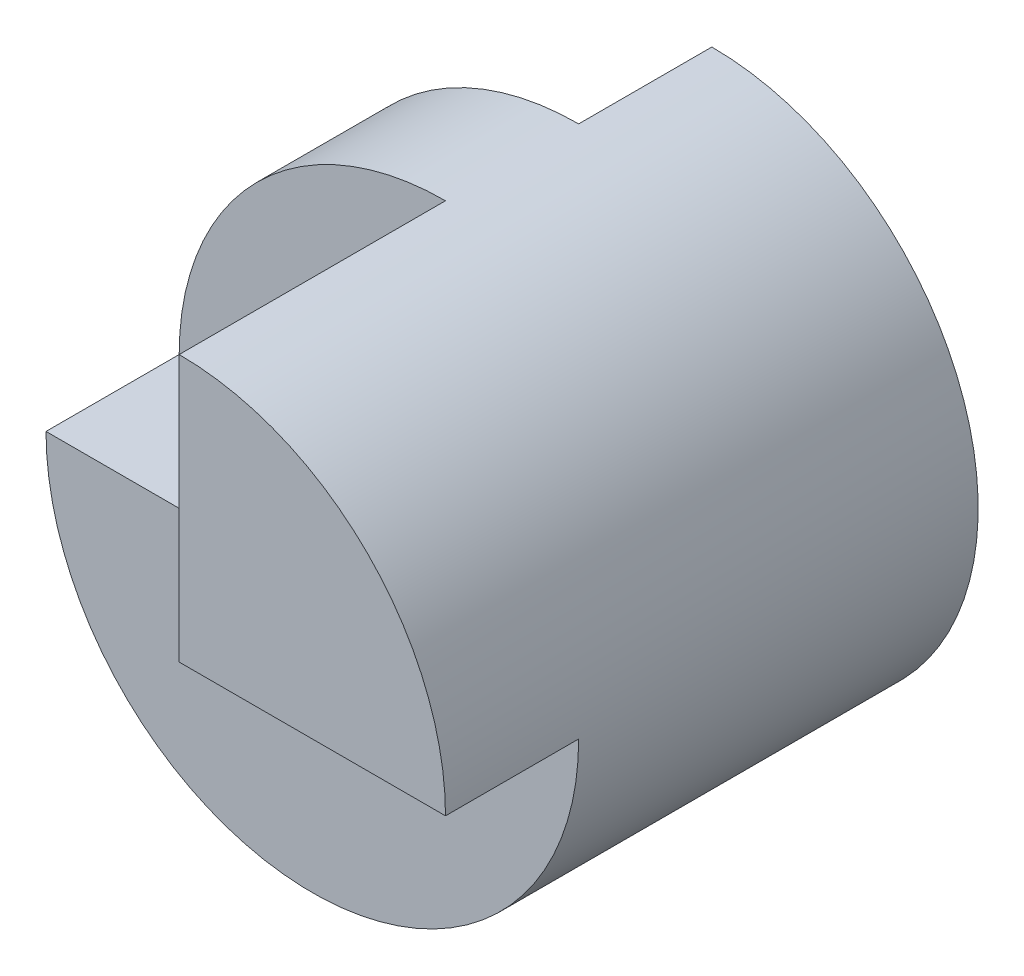
ISO-10303-21;
HEADER;
FILE_DESCRIPTION(('STEP AP214'),'2;1');
FILE_NAME('part.step','',(''),(''),'','','');
FILE_SCHEMA(('AUTOMOTIVE_DESIGN { 1 0 10303 214 1 1 1 1 }'));
ENDSEC;
DATA;
#1=APPLICATION_CONTEXT('core data for automotive mechanical design processes');
#2=APPLICATION_PROTOCOL_DEFINITION('international standard','automotive_design',2000,#1);
#3=PRODUCT_CONTEXT('',#1,'mechanical');
#4=PRODUCT('Part','Part','',(#3));
#5=PRODUCT_RELATED_PRODUCT_CATEGORY('part','',(#4));
#6=PRODUCT_DEFINITION_FORMATION('','',#4);
#7=PRODUCT_DEFINITION_CONTEXT('part definition',#1,'design');
#8=PRODUCT_DEFINITION('design','',#6,#7);
#9=PRODUCT_DEFINITION_SHAPE('','',#8);
#10=(LENGTH_UNIT() NAMED_UNIT(*) SI_UNIT(.MILLI.,.METRE.));
#11=(NAMED_UNIT(*) PLANE_ANGLE_UNIT() SI_UNIT($,.RADIAN.));
#12=(NAMED_UNIT(*) SI_UNIT($,.STERADIAN.) SOLID_ANGLE_UNIT());
#13=UNCERTAINTY_MEASURE_WITH_UNIT(LENGTH_MEASURE(1.E-05),#10,'distance_accuracy_value','');
#14=(GEOMETRIC_REPRESENTATION_CONTEXT(3) GLOBAL_UNCERTAINTY_ASSIGNED_CONTEXT((#13)) GLOBAL_UNIT_ASSIGNED_CONTEXT((#10,
#11,#12)) REPRESENTATION_CONTEXT('',''));
#15=CARTESIAN_POINT('',(0.,0.,0.));
#16=DIRECTION('',(0.,0.,1.));
#17=DIRECTION('',(1.,0.,0.));
#18=AXIS2_PLACEMENT_3D('',#15,#16,#17);
#19=CARTESIAN_POINT('',(0.,0.,40.));
#20=DIRECTION('',(0.,0.,-1.));
#21=DIRECTION('',(-1.,0.,0.));
#22=AXIS2_PLACEMENT_3D('',#19,#20,#21);
#23=CYLINDRICAL_SURFACE('',#22,20.);
#24=DIRECTION('',(0.,0.,-1.));
#25=VECTOR('',#24,1.);
#26=CARTESIAN_POINT('',(0.,20.,40.));
#27=LINE('',#26,#25);
#28=CARTESIAN_POINT('',(0.,20.,10.));
#29=VERTEX_POINT('',#28);
#30=CARTESIAN_POINT('',(0.,20.,0.));
#31=VERTEX_POINT('',#30);
#32=EDGE_CURVE('E55',#29,#31,#27,.T.);
#33=ORIENTED_EDGE('',*,*,#32,.F.);
#34=CARTESIAN_POINT('',(0.,0.,10.));
#35=DIRECTION('',(0.,0.,-1.));
#36=DIRECTION('',(-1.,0.,0.));
#37=AXIS2_PLACEMENT_3D('',#34,#35,#36);
#38=CIRCLE('',#37,20.);
#39=CARTESIAN_POINT('',(0.,-20.,10.));
#40=VERTEX_POINT('',#39);
#41=EDGE_CURVE('E140',#40,#29,#38,.T.);
#42=ORIENTED_EDGE('',*,*,#41,.F.);
#43=DIRECTION('',(0.,0.,-1.));
#44=VECTOR('',#43,1.);
#45=CARTESIAN_POINT('',(0.,-20.,40.));
#46=LINE('',#45,#44);
#47=CARTESIAN_POINT('',(0.,-20.,0.));
#48=VERTEX_POINT('',#47);
#49=EDGE_CURVE('E130',#48,#40,#46,.F.);
#50=ORIENTED_EDGE('',*,*,#49,.F.);
#51=CARTESIAN_POINT('',(0.,0.,0.));
#52=DIRECTION('',(0.,0.,1.));
#53=DIRECTION('',(1.,0.,0.));
#54=AXIS2_PLACEMENT_3D('',#51,#52,#53);
#55=CIRCLE('',#54,20.);
#56=EDGE_CURVE('E133',#48,#31,#55,.T.);
#57=ORIENTED_EDGE('',*,*,#56,.T.);
#58=EDGE_LOOP('',(#33,#42,#50,#57));
#59=FACE_BOUND('',#58,.T.);
#60=CARTESIAN_POINT('',(0.,0.,20.));
#61=DIRECTION('',(0.,0.,1.));
#62=DIRECTION('',(1.,0.,0.));
#63=AXIS2_PLACEMENT_3D('',#60,#61,#62);
#64=CIRCLE('',#63,20.);
#65=CARTESIAN_POINT('',(0.,20.,20.));
#66=VERTEX_POINT('',#65);
#67=CARTESIAN_POINT('',(-20.,0.,20.));
#68=VERTEX_POINT('',#67);
#69=EDGE_CURVE('E105',#66,#68,#64,.T.);
#70=ORIENTED_EDGE('',*,*,#69,.F.);
#71=DIRECTION('',(0.,0.,-1.));
#72=VECTOR('',#71,1.);
#73=CARTESIAN_POINT('',(0.,20.,40.));
#74=LINE('',#73,#72);
#75=CARTESIAN_POINT('',(0.,20.,40.));
#76=VERTEX_POINT('',#75);
#77=EDGE_CURVE('E90',#76,#66,#74,.T.);
#78=ORIENTED_EDGE('',*,*,#77,.F.);
#79=CARTESIAN_POINT('',(0.,0.,40.));
#80=DIRECTION('',(0.,0.,1.));
#81=DIRECTION('',(1.,0.,0.));
#82=AXIS2_PLACEMENT_3D('',#79,#80,#81);
#83=CIRCLE('',#82,20.);
#84=CARTESIAN_POINT('',(20.,0.,40.));
#85=VERTEX_POINT('',#84);
#86=EDGE_CURVE('E134',#85,#76,#83,.T.);
#87=ORIENTED_EDGE('',*,*,#86,.F.);
#88=DIRECTION('',(0.,0.,-1.));
#89=VECTOR('',#88,1.);
#90=CARTESIAN_POINT('',(20.,0.,40.));
#91=LINE('',#90,#89);
#92=CARTESIAN_POINT('',(20.,0.,30.));
#93=VERTEX_POINT('',#92);
#94=EDGE_CURVE('E101',#85,#93,#91,.T.);
#95=ORIENTED_EDGE('',*,*,#94,.T.);
#96=CARTESIAN_POINT('',(0.,0.,30.));
#97=DIRECTION('',(0.,0.,1.));
#98=DIRECTION('',(1.,0.,0.));
#99=AXIS2_PLACEMENT_3D('',#96,#97,#98);
#100=CIRCLE('',#99,20.);
#101=CARTESIAN_POINT('',(-20.,0.,30.));
#102=VERTEX_POINT('',#101);
#103=EDGE_CURVE('E11',#102,#93,#100,.T.);
#104=ORIENTED_EDGE('',*,*,#103,.F.);
#105=DIRECTION('',(0.,0.,1.));
#106=VECTOR('',#105,1.);
#107=CARTESIAN_POINT('',(-20.,0.,20.));
#108=LINE('',#107,#106);
#109=EDGE_CURVE('E112',#68,#102,#108,.T.);
#110=ORIENTED_EDGE('',*,*,#109,.F.);
#111=EDGE_LOOP('',(#70,#78,#87,#95,#104,#110));
#112=FACE_BOUND('',#111,.T.);
#113=ADVANCED_FACE('F33',(#59,#112),#23,.T.);
#114=CARTESIAN_POINT('',(0.,0.,40.));
#115=DIRECTION('',(0.,0.,1.));
#116=DIRECTION('',(1.,0.,0.));
#117=AXIS2_PLACEMENT_3D('',#114,#115,#116);
#118=PLANE('',#117);
#119=DIRECTION('',(-1.,0.,0.));
#120=VECTOR('',#119,1.);
#121=CARTESIAN_POINT('',(40.,0.,40.));
#122=LINE('',#121,#120);
#123=CARTESIAN_POINT('',(0.,0.,40.));
#124=VERTEX_POINT('',#123);
#125=EDGE_CURVE('E47',#85,#124,#122,.T.);
#126=ORIENTED_EDGE('',*,*,#125,.F.);
#127=ORIENTED_EDGE('',*,*,#86,.T.);
#128=DIRECTION('',(0.,-1.,0.));
#129=VECTOR('',#128,1.);
#130=CARTESIAN_POINT('',(0.,0.,40.));
#131=LINE('',#130,#129);
#132=EDGE_CURVE('E40',#76,#124,#131,.T.);
#133=ORIENTED_EDGE('',*,*,#132,.T.);
#134=EDGE_LOOP('',(#126,#127,#133));
#135=FACE_BOUND('',#134,.T.);
#136=ADVANCED_FACE('F142',(#135),#118,.T.);
#137=CARTESIAN_POINT('',(0.,0.,0.));
#138=DIRECTION('',(0.,0.,1.));
#139=DIRECTION('',(1.,0.,0.));
#140=AXIS2_PLACEMENT_3D('',#137,#138,#139);
#141=PLANE('',#140);
#142=DIRECTION('',(0.,-1.,0.));
#143=VECTOR('',#142,1.);
#144=CARTESIAN_POINT('',(0.,0.,0.));
#145=LINE('',#144,#143);
#146=EDGE_CURVE('E136',#31,#48,#145,.T.);
#147=ORIENTED_EDGE('',*,*,#146,.F.);
#148=ORIENTED_EDGE('',*,*,#56,.F.);
#149=EDGE_LOOP('',(#147,#148));
#150=FACE_BOUND('',#149,.T.);
#151=ADVANCED_FACE('F163',(#150),#141,.F.);
#152=CARTESIAN_POINT('',(-20.,40.,10.));
#153=DIRECTION('',(0.,0.,-1.));
#154=DIRECTION('',(-1.,0.,0.));
#155=AXIS2_PLACEMENT_3D('',#152,#153,#154);
#156=PLANE('',#155);
#157=ORIENTED_EDGE('',*,*,#41,.T.);
#158=DIRECTION('',(0.,-1.,0.));
#159=VECTOR('',#158,1.);
#160=CARTESIAN_POINT('',(0.,40.,10.));
#161=LINE('',#160,#159);
#162=EDGE_CURVE('E100',#29,#40,#161,.T.);
#163=ORIENTED_EDGE('',*,*,#162,.T.);
#164=EDGE_LOOP('',(#157,#163));
#165=FACE_BOUND('',#164,.T.);
#166=ADVANCED_FACE('F171',(#165),#156,.T.);
#167=CARTESIAN_POINT('',(0.,40.,0.));
#168=DIRECTION('',(-1.,0.,0.));
#169=DIRECTION('',(0.,0.,1.));
#170=AXIS2_PLACEMENT_3D('',#167,#168,#169);
#171=PLANE('',#170);
#172=ORIENTED_EDGE('',*,*,#32,.T.);
#173=ORIENTED_EDGE('',*,*,#146,.T.);
#174=ORIENTED_EDGE('',*,*,#49,.T.);
#175=ORIENTED_EDGE('',*,*,#162,.F.);
#176=EDGE_LOOP('',(#172,#173,#174,#175));
#177=FACE_BOUND('',#176,.T.);
#178=ADVANCED_FACE('F169',(#177),#171,.T.);
#179=CARTESIAN_POINT('',(-20.,40.,30.));
#180=DIRECTION('',(0.,0.,1.));
#181=DIRECTION('',(1.,0.,0.));
#182=AXIS2_PLACEMENT_3D('',#179,#180,#181);
#183=PLANE('',#182);
#184=DIRECTION('',(1.,0.,0.));
#185=VECTOR('',#184,1.);
#186=CARTESIAN_POINT('',(-20.,0.,30.));
#187=LINE('',#186,#185);
#188=CARTESIAN_POINT('',(0.,0.,30.));
#189=VERTEX_POINT('',#188);
#190=EDGE_CURVE('E108',#102,#189,#187,.T.);
#191=ORIENTED_EDGE('',*,*,#190,.F.);
#192=ORIENTED_EDGE('',*,*,#103,.T.);
#193=DIRECTION('',(-1.,0.,0.));
#194=VECTOR('',#193,1.);
#195=CARTESIAN_POINT('',(40.,0.,30.));
#196=LINE('',#195,#194);
#197=EDGE_CURVE('E122',#93,#189,#196,.T.);
#198=ORIENTED_EDGE('',*,*,#197,.T.);
#199=EDGE_LOOP('',(#191,#192,#198));
#200=FACE_BOUND('',#199,.T.);
#201=ADVANCED_FACE('F147',(#200),#183,.T.);
#202=CARTESIAN_POINT('',(0.,40.,40.));
#203=DIRECTION('',(-1.,0.,0.));
#204=DIRECTION('',(0.,0.,1.));
#205=AXIS2_PLACEMENT_3D('',#202,#203,#204);
#206=PLANE('',#205);
#207=DIRECTION('',(0.,0.,-1.));
#208=VECTOR('',#207,1.);
#209=CARTESIAN_POINT('',(0.,0.,40.));
#210=LINE('',#209,#208);
#211=EDGE_CURVE('E119',#124,#189,#210,.T.);
#212=ORIENTED_EDGE('',*,*,#211,.F.);
#213=ORIENTED_EDGE('',*,*,#132,.F.);
#214=ORIENTED_EDGE('',*,*,#77,.T.);
#215=DIRECTION('',(0.,1.,0.));
#216=VECTOR('',#215,1.);
#217=CARTESIAN_POINT('',(0.,0.,20.));
#218=LINE('',#217,#216);
#219=CARTESIAN_POINT('',(0.,0.,20.));
#220=VERTEX_POINT('',#219);
#221=EDGE_CURVE('E94',#220,#66,#218,.T.);
#222=ORIENTED_EDGE('',*,*,#221,.F.);
#223=DIRECTION('',(0.,0.,1.));
#224=VECTOR('',#223,1.);
#225=CARTESIAN_POINT('',(0.,0.,20.));
#226=LINE('',#225,#224);
#227=EDGE_CURVE('E117',#220,#189,#226,.T.);
#228=ORIENTED_EDGE('',*,*,#227,.T.);
#229=EDGE_LOOP('',(#212,#213,#214,#222,#228));
#230=FACE_BOUND('',#229,.T.);
#231=ADVANCED_FACE('F92',(#230),#206,.T.);
#232=CARTESIAN_POINT('',(40.,0.,40.));
#233=DIRECTION('',(0.,1.,0.));
#234=DIRECTION('',(0.,0.,1.));
#235=AXIS2_PLACEMENT_3D('',#232,#233,#234);
#236=PLANE('',#235);
#237=ORIENTED_EDGE('',*,*,#125,.T.);
#238=ORIENTED_EDGE('',*,*,#211,.T.);
#239=ORIENTED_EDGE('',*,*,#197,.F.);
#240=ORIENTED_EDGE('',*,*,#94,.F.);
#241=EDGE_LOOP('',(#237,#238,#239,#240));
#242=FACE_BOUND('',#241,.T.);
#243=ADVANCED_FACE('F144',(#242),#236,.F.);
#244=CARTESIAN_POINT('',(-20.,0.,20.));
#245=DIRECTION('',(0.,-1.,0.));
#246=DIRECTION('',(1.,0.,0.));
#247=AXIS2_PLACEMENT_3D('',#244,#245,#246);
#248=PLANE('',#247);
#249=ORIENTED_EDGE('',*,*,#190,.T.);
#250=ORIENTED_EDGE('',*,*,#227,.F.);
#251=DIRECTION('',(1.,0.,0.));
#252=VECTOR('',#251,1.);
#253=CARTESIAN_POINT('',(-20.,0.,20.));
#254=LINE('',#253,#252);
#255=EDGE_CURVE('E107',#68,#220,#254,.T.);
#256=ORIENTED_EDGE('',*,*,#255,.F.);
#257=ORIENTED_EDGE('',*,*,#109,.T.);
#258=EDGE_LOOP('',(#249,#250,#256,#257));
#259=FACE_BOUND('',#258,.T.);
#260=ADVANCED_FACE('F149',(#259),#248,.F.);
#261=CARTESIAN_POINT('',(0.,0.,20.));
#262=DIRECTION('',(0.,0.,1.));
#263=DIRECTION('',(1.,0.,0.));
#264=AXIS2_PLACEMENT_3D('',#261,#262,#263);
#265=PLANE('',#264);
#266=ORIENTED_EDGE('',*,*,#221,.T.);
#267=ORIENTED_EDGE('',*,*,#69,.T.);
#268=ORIENTED_EDGE('',*,*,#255,.T.);
#269=EDGE_LOOP('',(#266,#267,#268));
#270=FACE_BOUND('',#269,.T.);
#271=ADVANCED_FACE('F104',(#270),#265,.T.);
#272=CLOSED_SHELL('',(#113,#136,#151,#166,#178,#201,#231,#243,#260,#271));
#273=MANIFOLD_SOLID_BREP('B2',#272);
#274=ADVANCED_BREP_SHAPE_REPRESENTATION('',(#18,#273),#14);
#275=SHAPE_DEFINITION_REPRESENTATION(#9,#274);
ENDSEC;
END-ISO-10303-21;
